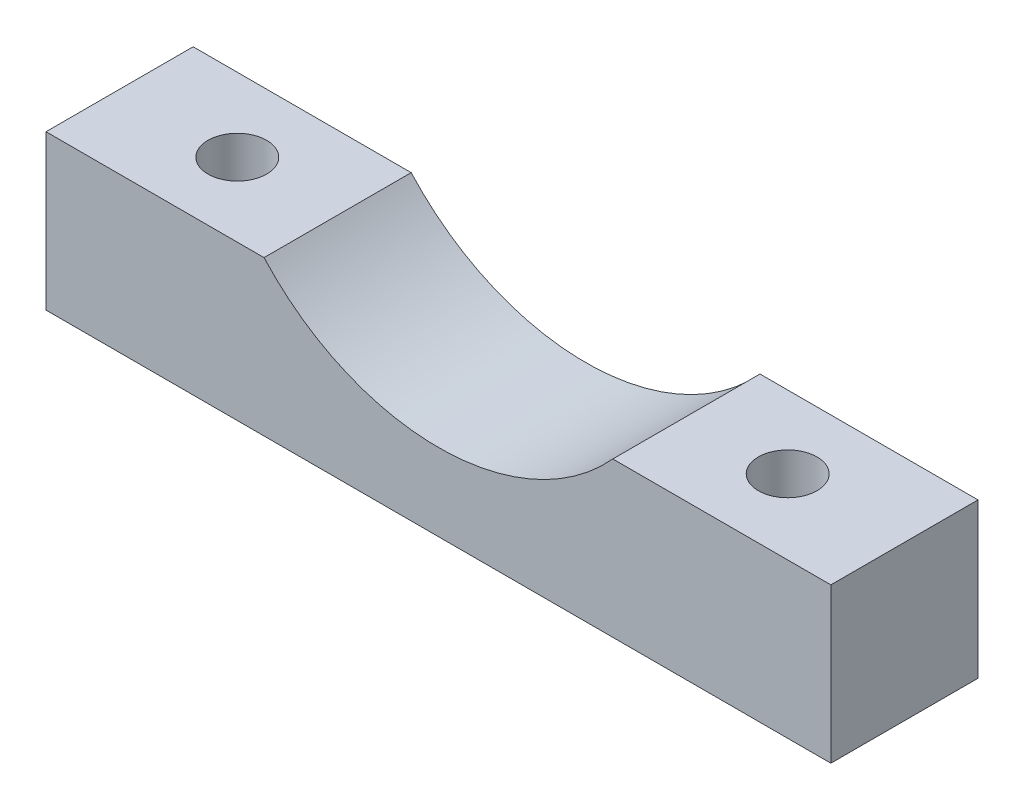
ISO-10303-21;
HEADER;
FILE_DESCRIPTION(('STEP AP214'),'2;1');
FILE_NAME('part.step','',(''),(''),'','','');
FILE_SCHEMA(('AUTOMOTIVE_DESIGN { 1 0 10303 214 1 1 1 1 }'));
ENDSEC;
DATA;
#1=APPLICATION_CONTEXT('core data for automotive mechanical design processes');
#2=APPLICATION_PROTOCOL_DEFINITION('international standard','automotive_design',2000,#1);
#3=PRODUCT_CONTEXT('',#1,'mechanical');
#4=PRODUCT('Part','Part','',(#3));
#5=PRODUCT_RELATED_PRODUCT_CATEGORY('part','',(#4));
#6=PRODUCT_DEFINITION_FORMATION('','',#4);
#7=PRODUCT_DEFINITION_CONTEXT('part definition',#1,'design');
#8=PRODUCT_DEFINITION('design','',#6,#7);
#9=PRODUCT_DEFINITION_SHAPE('','',#8);
#10=(LENGTH_UNIT() NAMED_UNIT(*) SI_UNIT(.MILLI.,.METRE.));
#11=(NAMED_UNIT(*) PLANE_ANGLE_UNIT() SI_UNIT($,.RADIAN.));
#12=(NAMED_UNIT(*) SI_UNIT($,.STERADIAN.) SOLID_ANGLE_UNIT());
#13=UNCERTAINTY_MEASURE_WITH_UNIT(LENGTH_MEASURE(1.E-05),#10,'distance_accuracy_value','');
#14=(GEOMETRIC_REPRESENTATION_CONTEXT(3) GLOBAL_UNCERTAINTY_ASSIGNED_CONTEXT((#13)) GLOBAL_UNIT_ASSIGNED_CONTEXT((#10,
#11,#12)) REPRESENTATION_CONTEXT('',''));
#15=CARTESIAN_POINT('',(0.,0.,0.));
#16=DIRECTION('',(0.,0.,1.));
#17=DIRECTION('',(1.,0.,0.));
#18=AXIS2_PLACEMENT_3D('',#15,#16,#17);
#19=CARTESIAN_POINT('',(0.,10.,0.));
#20=DIRECTION('',(0.,1.,0.));
#21=DIRECTION('',(0.,0.,1.));
#22=AXIS2_PLACEMENT_3D('',#19,#20,#21);
#23=PLANE('',#22);
#24=CARTESIAN_POINT('',(-7.62005669647377,10.,-4.826));
#25=DIRECTION('',(0.,-1.,0.));
#26=DIRECTION('',(0.,0.,-1.));
#27=AXIS2_PLACEMENT_3D('',#24,#25,#26);
#28=CIRCLE('',#27,1.89865);
#29=CARTESIAN_POINT('',(-7.62005669647377,10.,-6.72465));
#30=VERTEX_POINT('',#29);
#31=EDGE_CURVE('E150',#30,#30,#28,.T.);
#32=ORIENTED_EDGE('',*,*,#31,.T.);
#33=EDGE_LOOP('',(#32));
#34=FACE_BOUND('',#33,.T.);
#35=DIRECTION('',(0.,0.,-1.));
#36=VECTOR('',#35,1.);
#37=CARTESIAN_POINT('',(-14.112839152382,10.,0.));
#38=LINE('',#37,#36);
#39=CARTESIAN_POINT('',(-14.112839152382,10.,0.));
#40=VERTEX_POINT('',#39);
#41=CARTESIAN_POINT('',(-14.112839152382,10.,-9.525));
#42=VERTEX_POINT('',#41);
#43=EDGE_CURVE('E11',#40,#42,#38,.T.);
#44=ORIENTED_EDGE('',*,*,#43,.F.);
#45=DIRECTION('',(1.,0.,0.));
#46=VECTOR('',#45,1.);
#47=CARTESIAN_POINT('',(0.,10.,0.));
#48=LINE('',#47,#46);
#49=CARTESIAN_POINT('',(0.,10.,0.));
#50=VERTEX_POINT('',#49);
#51=EDGE_CURVE('E54',#40,#50,#48,.T.);
#52=ORIENTED_EDGE('',*,*,#51,.T.);
#53=DIRECTION('',(0.,0.,-1.));
#54=VECTOR('',#53,1.);
#55=CARTESIAN_POINT('',(0.,10.,0.));
#56=LINE('',#55,#54);
#57=CARTESIAN_POINT('',(0.,10.,-9.525));
#58=VERTEX_POINT('',#57);
#59=EDGE_CURVE('E97',#50,#58,#56,.T.);
#60=ORIENTED_EDGE('',*,*,#59,.T.);
#61=DIRECTION('',(-1.,0.,0.));
#62=VECTOR('',#61,1.);
#63=CARTESIAN_POINT('',(0.,10.,-9.525));
#64=LINE('',#63,#62);
#65=EDGE_CURVE('E91',#58,#42,#64,.T.);
#66=ORIENTED_EDGE('',*,*,#65,.T.);
#67=EDGE_LOOP('',(#44,#52,#60,#66));
#68=FACE_BOUND('',#67,.T.);
#69=ADVANCED_FACE('F32',(#34,#68),#23,.T.);
#70=CARTESIAN_POINT('',(0.,10.,0.));
#71=DIRECTION('',(-1.,0.,0.));
#72=DIRECTION('',(0.,0.,1.));
#73=AXIS2_PLACEMENT_3D('',#70,#71,#72);
#74=PLANE('',#73);
#75=DIRECTION('',(0.,0.,-1.));
#76=VECTOR('',#75,1.);
#77=CARTESIAN_POINT('',(0.,0.,0.));
#78=LINE('',#77,#76);
#79=CARTESIAN_POINT('',(0.,0.,0.));
#80=VERTEX_POINT('',#79);
#81=CARTESIAN_POINT('',(0.,0.,-9.525));
#82=VERTEX_POINT('',#81);
#83=EDGE_CURVE('E122',#80,#82,#78,.T.);
#84=ORIENTED_EDGE('',*,*,#83,.T.);
#85=DIRECTION('',(0.,-1.,0.));
#86=VECTOR('',#85,1.);
#87=CARTESIAN_POINT('',(0.,10.,-9.525));
#88=LINE('',#87,#86);
#89=EDGE_CURVE('E117',#58,#82,#88,.T.);
#90=ORIENTED_EDGE('',*,*,#89,.F.);
#91=ORIENTED_EDGE('',*,*,#59,.F.);
#92=DIRECTION('',(0.,-1.,0.));
#93=VECTOR('',#92,1.);
#94=CARTESIAN_POINT('',(0.,10.,0.));
#95=LINE('',#94,#93);
#96=EDGE_CURVE('E108',#50,#80,#95,.T.);
#97=ORIENTED_EDGE('',*,*,#96,.T.);
#98=EDGE_LOOP('',(#84,#90,#91,#97));
#99=FACE_BOUND('',#98,.T.);
#100=ADVANCED_FACE('F34',(#99),#74,.F.);
#101=CARTESIAN_POINT('',(0.,10.,-9.525));
#102=DIRECTION('',(0.,0.,1.));
#103=DIRECTION('',(1.,0.,0.));
#104=AXIS2_PLACEMENT_3D('',#101,#102,#103);
#105=PLANE('',#104);
#106=CARTESIAN_POINT('',(-36.687160847618,10.,-9.525));
#107=VERTEX_POINT('',#106);
#108=CARTESIAN_POINT('',(-50.8,10.,-9.52499999999999));
#109=VERTEX_POINT('',#108);
#110=EDGE_CURVE('E93',#107,#109,#64,.T.);
#111=ORIENTED_EDGE('',*,*,#110,.F.);
#112=CARTESIAN_POINT('',(-25.4,20.24,-9.525));
#113=DIRECTION('',(0.,0.,-1.));
#114=DIRECTION('',(-1.,0.,0.));
#115=AXIS2_PLACEMENT_3D('',#112,#113,#114);
#116=CIRCLE('',#115,15.24);
#117=EDGE_CURVE('E46',#42,#107,#116,.T.);
#118=ORIENTED_EDGE('',*,*,#117,.F.);
#119=ORIENTED_EDGE('',*,*,#65,.F.);
#120=ORIENTED_EDGE('',*,*,#89,.T.);
#121=DIRECTION('',(-1.,0.,0.));
#122=VECTOR('',#121,1.);
#123=CARTESIAN_POINT('',(0.,0.,-9.525));
#124=LINE('',#123,#122);
#125=CARTESIAN_POINT('',(-50.8,0.,-9.52499999999999));
#126=VERTEX_POINT('',#125);
#127=EDGE_CURVE('E137',#82,#126,#124,.T.);
#128=ORIENTED_EDGE('',*,*,#127,.T.);
#129=DIRECTION('',(0.,-1.,0.));
#130=VECTOR('',#129,1.);
#131=CARTESIAN_POINT('',(-50.8,10.,-9.52499999999999));
#132=LINE('',#131,#130);
#133=EDGE_CURVE('E114',#109,#126,#132,.T.);
#134=ORIENTED_EDGE('',*,*,#133,.F.);
#135=EDGE_LOOP('',(#111,#118,#119,#120,#128,#134));
#136=FACE_BOUND('',#135,.T.);
#137=ADVANCED_FACE('F89',(#136),#105,.F.);
#138=CARTESIAN_POINT('',(-50.8,10.,0.));
#139=DIRECTION('',(1.,0.,0.));
#140=DIRECTION('',(0.,0.,-1.));
#141=AXIS2_PLACEMENT_3D('',#138,#139,#140);
#142=PLANE('',#141);
#143=DIRECTION('',(0.,0.,1.));
#144=VECTOR('',#143,1.);
#145=CARTESIAN_POINT('',(-50.8,0.,0.));
#146=LINE('',#145,#144);
#147=CARTESIAN_POINT('',(-50.8,0.,0.));
#148=VERTEX_POINT('',#147);
#149=EDGE_CURVE('E130',#126,#148,#146,.T.);
#150=ORIENTED_EDGE('',*,*,#149,.T.);
#151=DIRECTION('',(0.,-1.,0.));
#152=VECTOR('',#151,1.);
#153=CARTESIAN_POINT('',(-50.8,10.,0.));
#154=LINE('',#153,#152);
#155=CARTESIAN_POINT('',(-50.8,10.,0.));
#156=VERTEX_POINT('',#155);
#157=EDGE_CURVE('E111',#156,#148,#154,.T.);
#158=ORIENTED_EDGE('',*,*,#157,.F.);
#159=DIRECTION('',(0.,0.,1.));
#160=VECTOR('',#159,1.);
#161=CARTESIAN_POINT('',(-50.8,10.,0.));
#162=LINE('',#161,#160);
#163=EDGE_CURVE('E99',#109,#156,#162,.T.);
#164=ORIENTED_EDGE('',*,*,#163,.F.);
#165=ORIENTED_EDGE('',*,*,#133,.T.);
#166=EDGE_LOOP('',(#150,#158,#164,#165));
#167=FACE_BOUND('',#166,.T.);
#168=ADVANCED_FACE('F128',(#167),#142,.F.);
#169=CARTESIAN_POINT('',(0.,10.,0.));
#170=DIRECTION('',(0.,0.,-1.));
#171=DIRECTION('',(-1.,0.,0.));
#172=AXIS2_PLACEMENT_3D('',#169,#170,#171);
#173=PLANE('',#172);
#174=ORIENTED_EDGE('',*,*,#51,.F.);
#175=CARTESIAN_POINT('',(-25.4,20.24,0.));
#176=DIRECTION('',(0.,0.,-1.));
#177=DIRECTION('',(-1.,0.,0.));
#178=AXIS2_PLACEMENT_3D('',#175,#176,#177);
#179=CIRCLE('',#178,15.24);
#180=CARTESIAN_POINT('',(-36.687160847618,10.,0.));
#181=VERTEX_POINT('',#180);
#182=EDGE_CURVE('E85',#40,#181,#179,.T.);
#183=ORIENTED_EDGE('',*,*,#182,.T.);
#184=EDGE_CURVE('E105',#156,#181,#48,.T.);
#185=ORIENTED_EDGE('',*,*,#184,.F.);
#186=ORIENTED_EDGE('',*,*,#157,.T.);
#187=DIRECTION('',(1.,0.,0.));
#188=VECTOR('',#187,1.);
#189=CARTESIAN_POINT('',(0.,0.,0.));
#190=LINE('',#189,#188);
#191=EDGE_CURVE('E132',#148,#80,#190,.T.);
#192=ORIENTED_EDGE('',*,*,#191,.T.);
#193=ORIENTED_EDGE('',*,*,#96,.F.);
#194=EDGE_LOOP('',(#174,#183,#185,#186,#192,#193));
#195=FACE_BOUND('',#194,.T.);
#196=ADVANCED_FACE('F121',(#195),#173,.F.);
#197=CARTESIAN_POINT('',(-43.18,10.,-4.76249999999999));
#198=DIRECTION('',(0.,-1.,0.));
#199=DIRECTION('',(0.,0.,-1.));
#200=AXIS2_PLACEMENT_3D('',#197,#198,#199);
#201=CIRCLE('',#200,1.89864999999999);
#202=CARTESIAN_POINT('',(-43.18,10.,-6.66114999999999));
#203=VERTEX_POINT('',#202);
#204=EDGE_CURVE('E162',#203,#203,#201,.T.);
#205=ORIENTED_EDGE('',*,*,#204,.T.);
#206=EDGE_LOOP('',(#205));
#207=FACE_BOUND('',#206,.T.);
#208=DIRECTION('',(0.,0.,-1.));
#209=VECTOR('',#208,1.);
#210=CARTESIAN_POINT('',(-36.687160847618,10.,0.));
#211=LINE('',#210,#209);
#212=EDGE_CURVE('E40',#107,#181,#211,.F.);
#213=ORIENTED_EDGE('',*,*,#212,.F.);
#214=ORIENTED_EDGE('',*,*,#110,.T.);
#215=ORIENTED_EDGE('',*,*,#163,.T.);
#216=ORIENTED_EDGE('',*,*,#184,.T.);
#217=EDGE_LOOP('',(#213,#214,#215,#216));
#218=FACE_BOUND('',#217,.T.);
#219=ADVANCED_FACE('F124',(#207,#218),#23,.T.);
#220=CARTESIAN_POINT('',(0.,0.,0.));
#221=DIRECTION('',(0.,1.,0.));
#222=DIRECTION('',(0.,0.,1.));
#223=AXIS2_PLACEMENT_3D('',#220,#221,#222);
#224=PLANE('',#223);
#225=CARTESIAN_POINT('',(-43.18,0.,-4.76249999999999));
#226=DIRECTION('',(0.,-1.,0.));
#227=DIRECTION('',(0.,0.,-1.));
#228=AXIS2_PLACEMENT_3D('',#225,#226,#227);
#229=CIRCLE('',#228,3.57250999999999);
#230=CARTESIAN_POINT('',(-43.18,0.,-8.33500999999999));
#231=VERTEX_POINT('',#230);
#232=EDGE_CURVE('E153',#231,#231,#229,.T.);
#233=ORIENTED_EDGE('',*,*,#232,.F.);
#234=EDGE_LOOP('',(#233));
#235=FACE_BOUND('',#234,.T.);
#236=CARTESIAN_POINT('',(-7.62005669647377,0.,-4.826));
#237=DIRECTION('',(0.,-1.,0.));
#238=DIRECTION('',(0.,0.,-1.));
#239=AXIS2_PLACEMENT_3D('',#236,#237,#238);
#240=CIRCLE('',#239,3.57250999999999);
#241=CARTESIAN_POINT('',(-7.62005669647377,0.,-8.39850999999999));
#242=VERTEX_POINT('',#241);
#243=EDGE_CURVE('E94',#242,#242,#240,.T.);
#244=ORIENTED_EDGE('',*,*,#243,.F.);
#245=EDGE_LOOP('',(#244));
#246=FACE_BOUND('',#245,.T.);
#247=ORIENTED_EDGE('',*,*,#83,.F.);
#248=ORIENTED_EDGE('',*,*,#191,.F.);
#249=ORIENTED_EDGE('',*,*,#149,.F.);
#250=ORIENTED_EDGE('',*,*,#127,.F.);
#251=EDGE_LOOP('',(#247,#248,#249,#250));
#252=FACE_BOUND('',#251,.T.);
#253=ADVANCED_FACE('F135',(#235,#246,#252),#224,.F.);
#254=CARTESIAN_POINT('',(-25.4,20.24,0.));
#255=DIRECTION('',(0.,0.,-1.));
#256=DIRECTION('',(-1.,0.,0.));
#257=AXIS2_PLACEMENT_3D('',#254,#255,#256);
#258=CYLINDRICAL_SURFACE('',#257,15.24);
#259=ORIENTED_EDGE('',*,*,#43,.T.);
#260=ORIENTED_EDGE('',*,*,#117,.T.);
#261=ORIENTED_EDGE('',*,*,#212,.T.);
#262=ORIENTED_EDGE('',*,*,#182,.F.);
#263=EDGE_LOOP('',(#259,#260,#261,#262));
#264=FACE_BOUND('',#263,.T.);
#265=ADVANCED_FACE('F83',(#264),#258,.F.);
#266=CARTESIAN_POINT('',(-7.62005669647377,0.,-4.826));
#267=DIRECTION('',(0.,-1.,0.));
#268=DIRECTION('',(0.,0.,-1.));
#269=AXIS2_PLACEMENT_3D('',#266,#267,#268);
#270=CYLINDRICAL_SURFACE('',#269,3.57250999999999);
#271=CARTESIAN_POINT('',(-7.62005669647377,3.5052,-4.826));
#272=DIRECTION('',(0.,-1.,0.));
#273=DIRECTION('',(0.,0.,-1.));
#274=AXIS2_PLACEMENT_3D('',#271,#272,#273);
#275=CIRCLE('',#274,3.57250999999999);
#276=CARTESIAN_POINT('',(-7.62005669647377,3.5052,-8.39850999999999));
#277=VERTEX_POINT('',#276);
#278=EDGE_CURVE('E144',#277,#277,#275,.T.);
#279=ORIENTED_EDGE('',*,*,#278,.F.);
#280=EDGE_LOOP('',(#279));
#281=FACE_BOUND('',#280,.T.);
#282=ORIENTED_EDGE('',*,*,#243,.T.);
#283=EDGE_LOOP('',(#282));
#284=FACE_BOUND('',#283,.T.);
#285=ADVANCED_FACE('F191',(#281,#284),#270,.F.);
#286=CARTESIAN_POINT('',(-5.72140669647376,3.5052,-4.826));
#287=DIRECTION('',(0.,1.,0.));
#288=DIRECTION('',(0.,0.,1.));
#289=AXIS2_PLACEMENT_3D('',#286,#287,#288);
#290=PLANE('',#289);
#291=CARTESIAN_POINT('',(-7.62005669647377,3.5052,-4.826));
#292=DIRECTION('',(0.,-1.,0.));
#293=DIRECTION('',(0.,0.,-1.));
#294=AXIS2_PLACEMENT_3D('',#291,#292,#293);
#295=CIRCLE('',#294,1.89865000000001);
#296=CARTESIAN_POINT('',(-7.62005669647377,3.5052,-6.72465000000001));
#297=VERTEX_POINT('',#296);
#298=EDGE_CURVE('E147',#297,#297,#295,.T.);
#299=ORIENTED_EDGE('',*,*,#298,.F.);
#300=EDGE_LOOP('',(#299));
#301=FACE_BOUND('',#300,.T.);
#302=ORIENTED_EDGE('',*,*,#278,.T.);
#303=EDGE_LOOP('',(#302));
#304=FACE_BOUND('',#303,.T.);
#305=ADVANCED_FACE('F193',(#301,#304),#290,.F.);
#306=CARTESIAN_POINT('',(-7.62005669647377,0.,-4.826));
#307=DIRECTION('',(0.,-1.,0.));
#308=DIRECTION('',(0.,0.,-1.));
#309=AXIS2_PLACEMENT_3D('',#306,#307,#308);
#310=CYLINDRICAL_SURFACE('',#309,1.89865);
#311=ORIENTED_EDGE('',*,*,#31,.F.);
#312=EDGE_LOOP('',(#311));
#313=FACE_BOUND('',#312,.T.);
#314=ORIENTED_EDGE('',*,*,#298,.T.);
#315=EDGE_LOOP('',(#314));
#316=FACE_BOUND('',#315,.T.);
#317=ADVANCED_FACE('F182',(#313,#316),#310,.F.);
#318=CARTESIAN_POINT('',(-43.18,0.,-4.76249999999999));
#319=DIRECTION('',(0.,-1.,0.));
#320=DIRECTION('',(0.,0.,-1.));
#321=AXIS2_PLACEMENT_3D('',#318,#319,#320);
#322=CYLINDRICAL_SURFACE('',#321,3.57250999999999);
#323=CARTESIAN_POINT('',(-43.18,3.5052,-4.76249999999999));
#324=DIRECTION('',(0.,-1.,0.));
#325=DIRECTION('',(0.,0.,-1.));
#326=AXIS2_PLACEMENT_3D('',#323,#324,#325);
#327=CIRCLE('',#326,3.57250999999999);
#328=CARTESIAN_POINT('',(-43.18,3.5052,-8.33500999999999));
#329=VERTEX_POINT('',#328);
#330=EDGE_CURVE('E156',#329,#329,#327,.T.);
#331=ORIENTED_EDGE('',*,*,#330,.F.);
#332=EDGE_LOOP('',(#331));
#333=FACE_BOUND('',#332,.T.);
#334=ORIENTED_EDGE('',*,*,#232,.T.);
#335=EDGE_LOOP('',(#334));
#336=FACE_BOUND('',#335,.T.);
#337=ADVANCED_FACE('F176',(#333,#336),#322,.F.);
#338=CARTESIAN_POINT('',(-41.28135,3.5052,-4.76249999999999));
#339=DIRECTION('',(0.,1.,0.));
#340=DIRECTION('',(0.,0.,1.));
#341=AXIS2_PLACEMENT_3D('',#338,#339,#340);
#342=PLANE('',#341);
#343=CARTESIAN_POINT('',(-43.18,3.5052,-4.76249999999999));
#344=DIRECTION('',(0.,-1.,0.));
#345=DIRECTION('',(0.,0.,-1.));
#346=AXIS2_PLACEMENT_3D('',#343,#344,#345);
#347=CIRCLE('',#346,1.89865000000002);
#348=CARTESIAN_POINT('',(-43.18,3.5052,-6.66115000000001));
#349=VERTEX_POINT('',#348);
#350=EDGE_CURVE('E159',#349,#349,#347,.T.);
#351=ORIENTED_EDGE('',*,*,#350,.F.);
#352=EDGE_LOOP('',(#351));
#353=FACE_BOUND('',#352,.T.);
#354=ORIENTED_EDGE('',*,*,#330,.T.);
#355=EDGE_LOOP('',(#354));
#356=FACE_BOUND('',#355,.T.);
#357=ADVANCED_FACE('F170',(#353,#356),#342,.F.);
#358=CARTESIAN_POINT('',(-43.18,0.,-4.76249999999999));
#359=DIRECTION('',(0.,-1.,0.));
#360=DIRECTION('',(0.,0.,-1.));
#361=AXIS2_PLACEMENT_3D('',#358,#359,#360);
#362=CYLINDRICAL_SURFACE('',#361,1.89865000000001);
#363=ORIENTED_EDGE('',*,*,#204,.F.);
#364=EDGE_LOOP('',(#363));
#365=FACE_BOUND('',#364,.T.);
#366=ORIENTED_EDGE('',*,*,#350,.T.);
#367=EDGE_LOOP('',(#366));
#368=FACE_BOUND('',#367,.T.);
#369=ADVANCED_FACE('F167',(#365,#368),#362,.F.);
#370=CLOSED_SHELL('',(#69,#100,#137,#168,#196,#219,#253,#265,#285,#305,#317,#337,#357,#369));
#371=MANIFOLD_SOLID_BREP('B2',#370);
#372=ADVANCED_BREP_SHAPE_REPRESENTATION('',(#18,#371),#14);
#373=SHAPE_DEFINITION_REPRESENTATION(#9,#372);
ENDSEC;
END-ISO-10303-21;
